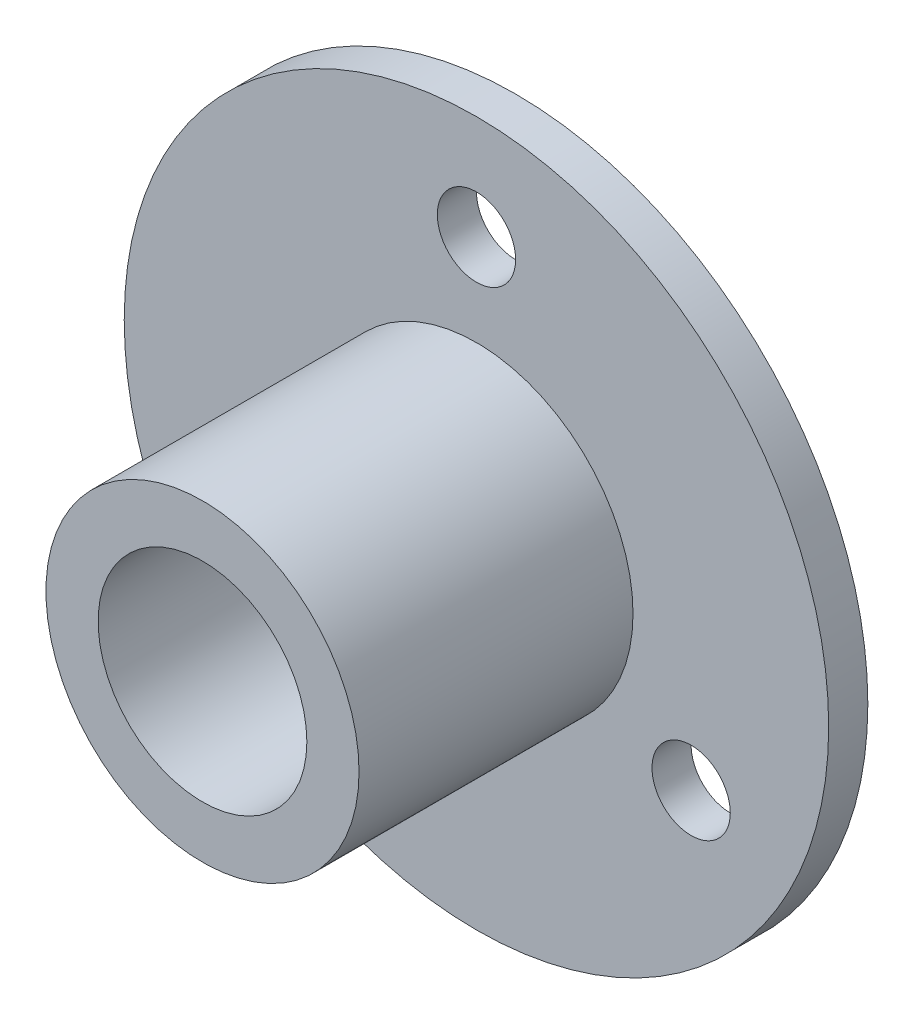
ISO-10303-21;
HEADER;
FILE_DESCRIPTION(('STEP AP214'),'2;1');
FILE_NAME('part.step','',(''),(''),'','','');
FILE_SCHEMA(('AUTOMOTIVE_DESIGN { 1 0 10303 214 1 1 1 1 }'));
ENDSEC;
DATA;
#1=APPLICATION_CONTEXT('core data for automotive mechanical design processes');
#2=APPLICATION_PROTOCOL_DEFINITION('international standard','automotive_design',2000,#1);
#3=PRODUCT_CONTEXT('',#1,'mechanical');
#4=PRODUCT('Part','Part','',(#3));
#5=PRODUCT_RELATED_PRODUCT_CATEGORY('part','',(#4));
#6=PRODUCT_DEFINITION_FORMATION('','',#4);
#7=PRODUCT_DEFINITION_CONTEXT('part definition',#1,'design');
#8=PRODUCT_DEFINITION('design','',#6,#7);
#9=PRODUCT_DEFINITION_SHAPE('','',#8);
#10=(LENGTH_UNIT() NAMED_UNIT(*) SI_UNIT(.MILLI.,.METRE.));
#11=(NAMED_UNIT(*) PLANE_ANGLE_UNIT() SI_UNIT($,.RADIAN.));
#12=(NAMED_UNIT(*) SI_UNIT($,.STERADIAN.) SOLID_ANGLE_UNIT());
#13=UNCERTAINTY_MEASURE_WITH_UNIT(LENGTH_MEASURE(1.E-05),#10,'distance_accuracy_value','');
#14=(GEOMETRIC_REPRESENTATION_CONTEXT(3) GLOBAL_UNCERTAINTY_ASSIGNED_CONTEXT((#13)) GLOBAL_UNIT_ASSIGNED_CONTEXT((#10,
#11,#12)) REPRESENTATION_CONTEXT('',''));
#15=CARTESIAN_POINT('',(0.,0.,0.));
#16=DIRECTION('',(0.,0.,1.));
#17=DIRECTION('',(1.,0.,0.));
#18=AXIS2_PLACEMENT_3D('',#15,#16,#17);
#19=CARTESIAN_POINT('',(0.,0.,1.5));
#20=DIRECTION('',(0.,0.,1.));
#21=DIRECTION('',(1.,0.,0.));
#22=AXIS2_PLACEMENT_3D('',#19,#20,#21);
#23=PLANE('',#22);
#24=CARTESIAN_POINT('',(0.,0.,1.5));
#25=DIRECTION('',(0.,0.,1.));
#26=DIRECTION('',(1.,0.,0.));
#27=AXIS2_PLACEMENT_3D('',#24,#25,#26);
#28=CIRCLE('',#27,13.5);
#29=CARTESIAN_POINT('',(13.5,0.,1.5));
#30=VERTEX_POINT('',#29);
#31=EDGE_CURVE('E10',#30,#30,#28,.T.);
#32=ORIENTED_EDGE('',*,*,#31,.T.);
#33=EDGE_LOOP('',(#32));
#34=FACE_BOUND('',#33,.T.);
#35=CARTESIAN_POINT('',(8.22724133595218,-4.74999999999998,1.5));
#36=DIRECTION('',(0.,0.,1.));
#37=DIRECTION('',(1.,0.,0.));
#38=AXIS2_PLACEMENT_3D('',#35,#36,#37);
#39=CIRCLE('',#38,1.49999999999999);
#40=CARTESIAN_POINT('',(9.72724133595217,-4.74999999999998,1.5));
#41=VERTEX_POINT('',#40);
#42=EDGE_CURVE('E43',#41,#41,#39,.T.);
#43=ORIENTED_EDGE('',*,*,#42,.F.);
#44=EDGE_LOOP('',(#43));
#45=FACE_BOUND('',#44,.T.);
#46=CARTESIAN_POINT('',(-8.22724133595218,-4.74999999999998,1.5));
#47=DIRECTION('',(0.,0.,1.));
#48=DIRECTION('',(1.,0.,0.));
#49=AXIS2_PLACEMENT_3D('',#46,#47,#48);
#50=CIRCLE('',#49,1.5);
#51=CARTESIAN_POINT('',(-6.72724133595218,-4.74999999999998,1.5));
#52=VERTEX_POINT('',#51);
#53=EDGE_CURVE('E48',#52,#52,#50,.T.);
#54=ORIENTED_EDGE('',*,*,#53,.F.);
#55=EDGE_LOOP('',(#54));
#56=FACE_BOUND('',#55,.T.);
#57=CARTESIAN_POINT('',(0.,9.5,1.5));
#58=DIRECTION('',(0.,0.,1.));
#59=DIRECTION('',(1.,0.,0.));
#60=AXIS2_PLACEMENT_3D('',#57,#58,#59);
#61=CIRCLE('',#60,1.5);
#62=CARTESIAN_POINT('',(1.5,9.5,1.5));
#63=VERTEX_POINT('',#62);
#64=EDGE_CURVE('E66',#63,#63,#61,.T.);
#65=ORIENTED_EDGE('',*,*,#64,.F.);
#66=EDGE_LOOP('',(#65));
#67=FACE_BOUND('',#66,.T.);
#68=CARTESIAN_POINT('',(0.,0.,1.5));
#69=DIRECTION('',(0.,0.,1.));
#70=DIRECTION('',(1.,0.,0.));
#71=AXIS2_PLACEMENT_3D('',#68,#69,#70);
#72=CIRCLE('',#71,6.);
#73=CARTESIAN_POINT('',(6.,0.,1.5));
#74=VERTEX_POINT('',#73);
#75=EDGE_CURVE('E56',#74,#74,#72,.F.);
#76=ORIENTED_EDGE('',*,*,#75,.T.);
#77=EDGE_LOOP('',(#76));
#78=FACE_BOUND('',#77,.T.);
#79=ADVANCED_FACE('F35',(#34,#45,#56,#67,#78),#23,.T.);
#80=CARTESIAN_POINT('',(8.22724133595218,-4.74999999999998,1.5));
#81=DIRECTION('',(0.,0.,-1.));
#82=DIRECTION('',(-1.,0.,0.));
#83=AXIS2_PLACEMENT_3D('',#80,#81,#82);
#84=CYLINDRICAL_SURFACE('',#83,1.49999999999999);
#85=ORIENTED_EDGE('',*,*,#42,.T.);
#86=EDGE_LOOP('',(#85));
#87=FACE_BOUND('',#86,.T.);
#88=CARTESIAN_POINT('',(8.22724133595218,-4.74999999999998,0.));
#89=DIRECTION('',(0.,0.,1.));
#90=DIRECTION('',(1.,0.,0.));
#91=AXIS2_PLACEMENT_3D('',#88,#89,#90);
#92=CIRCLE('',#91,1.49999999999999);
#93=CARTESIAN_POINT('',(9.72724133595217,-4.74999999999998,0.));
#94=VERTEX_POINT('',#93);
#95=EDGE_CURVE('E61',#94,#94,#92,.T.);
#96=ORIENTED_EDGE('',*,*,#95,.F.);
#97=EDGE_LOOP('',(#96));
#98=FACE_BOUND('',#97,.T.);
#99=ADVANCED_FACE('F105',(#87,#98),#84,.F.);
#100=CARTESIAN_POINT('',(-8.22724133595218,-4.74999999999998,1.5));
#101=DIRECTION('',(0.,0.,-1.));
#102=DIRECTION('',(-1.,0.,0.));
#103=AXIS2_PLACEMENT_3D('',#100,#101,#102);
#104=CYLINDRICAL_SURFACE('',#103,1.5);
#105=ORIENTED_EDGE('',*,*,#53,.T.);
#106=EDGE_LOOP('',(#105));
#107=FACE_BOUND('',#106,.T.);
#108=CARTESIAN_POINT('',(-8.22724133595218,-4.74999999999998,0.));
#109=DIRECTION('',(0.,0.,1.));
#110=DIRECTION('',(1.,0.,0.));
#111=AXIS2_PLACEMENT_3D('',#108,#109,#110);
#112=CIRCLE('',#111,1.5);
#113=CARTESIAN_POINT('',(-6.72724133595218,-4.74999999999998,0.));
#114=VERTEX_POINT('',#113);
#115=EDGE_CURVE('E59',#114,#114,#112,.T.);
#116=ORIENTED_EDGE('',*,*,#115,.F.);
#117=EDGE_LOOP('',(#116));
#118=FACE_BOUND('',#117,.T.);
#119=ADVANCED_FACE('F109',(#107,#118),#104,.F.);
#120=CARTESIAN_POINT('',(0.,9.5,1.5));
#121=DIRECTION('',(0.,0.,-1.));
#122=DIRECTION('',(-1.,0.,0.));
#123=AXIS2_PLACEMENT_3D('',#120,#121,#122);
#124=CYLINDRICAL_SURFACE('',#123,1.5);
#125=ORIENTED_EDGE('',*,*,#64,.T.);
#126=EDGE_LOOP('',(#125));
#127=FACE_BOUND('',#126,.T.);
#128=CARTESIAN_POINT('',(0.,9.5,0.));
#129=DIRECTION('',(0.,0.,1.));
#130=DIRECTION('',(1.,0.,0.));
#131=AXIS2_PLACEMENT_3D('',#128,#129,#130);
#132=CIRCLE('',#131,1.5);
#133=CARTESIAN_POINT('',(1.5,9.5,0.));
#134=VERTEX_POINT('',#133);
#135=EDGE_CURVE('E55',#134,#134,#132,.T.);
#136=ORIENTED_EDGE('',*,*,#135,.F.);
#137=EDGE_LOOP('',(#136));
#138=FACE_BOUND('',#137,.T.);
#139=ADVANCED_FACE('F118',(#127,#138),#124,.F.);
#140=CARTESIAN_POINT('',(0.,0.,1.5));
#141=DIRECTION('',(0.,0.,-1.));
#142=DIRECTION('',(-1.,0.,0.));
#143=AXIS2_PLACEMENT_3D('',#140,#141,#142);
#144=CYLINDRICAL_SURFACE('',#143,4.);
#145=CARTESIAN_POINT('',(0.,0.,0.));
#146=DIRECTION('',(0.,0.,1.));
#147=DIRECTION('',(1.,0.,0.));
#148=AXIS2_PLACEMENT_3D('',#145,#146,#147);
#149=CIRCLE('',#148,4.);
#150=CARTESIAN_POINT('',(4.,0.,0.));
#151=VERTEX_POINT('',#150);
#152=EDGE_CURVE('E52',#151,#151,#149,.T.);
#153=ORIENTED_EDGE('',*,*,#152,.F.);
#154=EDGE_LOOP('',(#153));
#155=FACE_BOUND('',#154,.T.);
#156=CARTESIAN_POINT('',(0.,0.,12.));
#157=DIRECTION('',(0.,0.,1.));
#158=DIRECTION('',(1.,0.,0.));
#159=AXIS2_PLACEMENT_3D('',#156,#157,#158);
#160=CIRCLE('',#159,4.);
#161=CARTESIAN_POINT('',(4.,0.,12.));
#162=VERTEX_POINT('',#161);
#163=EDGE_CURVE('E80',#162,#162,#160,.T.);
#164=ORIENTED_EDGE('',*,*,#163,.T.);
#165=EDGE_LOOP('',(#164));
#166=FACE_BOUND('',#165,.T.);
#167=ADVANCED_FACE('F37',(#155,#166),#144,.F.);
#168=CARTESIAN_POINT('',(0.,0.,1.5));
#169=DIRECTION('',(0.,0.,-1.));
#170=DIRECTION('',(-1.,0.,0.));
#171=AXIS2_PLACEMENT_3D('',#168,#169,#170);
#172=CYLINDRICAL_SURFACE('',#171,13.5);
#173=ORIENTED_EDGE('',*,*,#31,.F.);
#174=EDGE_LOOP('',(#173));
#175=FACE_BOUND('',#174,.T.);
#176=CARTESIAN_POINT('',(0.,0.,0.));
#177=DIRECTION('',(0.,0.,1.));
#178=DIRECTION('',(1.,0.,0.));
#179=AXIS2_PLACEMENT_3D('',#176,#177,#178);
#180=CIRCLE('',#179,13.5);
#181=CARTESIAN_POINT('',(13.5,0.,0.));
#182=VERTEX_POINT('',#181);
#183=EDGE_CURVE('E39',#182,#182,#180,.T.);
#184=ORIENTED_EDGE('',*,*,#183,.T.);
#185=EDGE_LOOP('',(#184));
#186=FACE_BOUND('',#185,.T.);
#187=ADVANCED_FACE('F99',(#175,#186),#172,.T.);
#188=CARTESIAN_POINT('',(0.,0.,0.));
#189=DIRECTION('',(0.,0.,1.));
#190=DIRECTION('',(1.,0.,0.));
#191=AXIS2_PLACEMENT_3D('',#188,#189,#190);
#192=PLANE('',#191);
#193=ORIENTED_EDGE('',*,*,#152,.T.);
#194=EDGE_LOOP('',(#193));
#195=FACE_BOUND('',#194,.T.);
#196=ORIENTED_EDGE('',*,*,#183,.F.);
#197=EDGE_LOOP('',(#196));
#198=FACE_BOUND('',#197,.T.);
#199=ORIENTED_EDGE('',*,*,#95,.T.);
#200=EDGE_LOOP('',(#199));
#201=FACE_BOUND('',#200,.T.);
#202=ORIENTED_EDGE('',*,*,#115,.T.);
#203=EDGE_LOOP('',(#202));
#204=FACE_BOUND('',#203,.T.);
#205=ORIENTED_EDGE('',*,*,#135,.T.);
#206=EDGE_LOOP('',(#205));
#207=FACE_BOUND('',#206,.T.);
#208=ADVANCED_FACE('F93',(#195,#198,#201,#204,#207),#192,.F.);
#209=CARTESIAN_POINT('',(0.,0.,12.));
#210=DIRECTION('',(0.,0.,-1.));
#211=DIRECTION('',(-1.,0.,0.));
#212=AXIS2_PLACEMENT_3D('',#209,#210,#211);
#213=CYLINDRICAL_SURFACE('',#212,6.);
#214=ORIENTED_EDGE('',*,*,#75,.F.);
#215=EDGE_LOOP('',(#214));
#216=FACE_BOUND('',#215,.T.);
#217=CARTESIAN_POINT('',(0.,0.,12.));
#218=DIRECTION('',(0.,0.,1.));
#219=DIRECTION('',(1.,0.,0.));
#220=AXIS2_PLACEMENT_3D('',#217,#218,#219);
#221=CIRCLE('',#220,6.);
#222=CARTESIAN_POINT('',(6.,0.,12.));
#223=VERTEX_POINT('',#222);
#224=EDGE_CURVE('E77',#223,#223,#221,.T.);
#225=ORIENTED_EDGE('',*,*,#224,.F.);
#226=EDGE_LOOP('',(#225));
#227=FACE_BOUND('',#226,.T.);
#228=ADVANCED_FACE('F88',(#216,#227),#213,.T.);
#229=CARTESIAN_POINT('',(0.,0.,12.));
#230=DIRECTION('',(0.,0.,1.));
#231=DIRECTION('',(1.,0.,0.));
#232=AXIS2_PLACEMENT_3D('',#229,#230,#231);
#233=PLANE('',#232);
#234=ORIENTED_EDGE('',*,*,#163,.F.);
#235=EDGE_LOOP('',(#234));
#236=FACE_BOUND('',#235,.T.);
#237=ORIENTED_EDGE('',*,*,#224,.T.);
#238=EDGE_LOOP('',(#237));
#239=FACE_BOUND('',#238,.T.);
#240=ADVANCED_FACE('F85',(#236,#239),#233,.T.);
#241=CLOSED_SHELL('',(#79,#99,#119,#139,#167,#187,#208,#228,#240));
#242=MANIFOLD_SOLID_BREP('B2',#241);
#243=ADVANCED_BREP_SHAPE_REPRESENTATION('',(#18,#242),#14);
#244=SHAPE_DEFINITION_REPRESENTATION(#9,#243);
ENDSEC;
END-ISO-10303-21;
